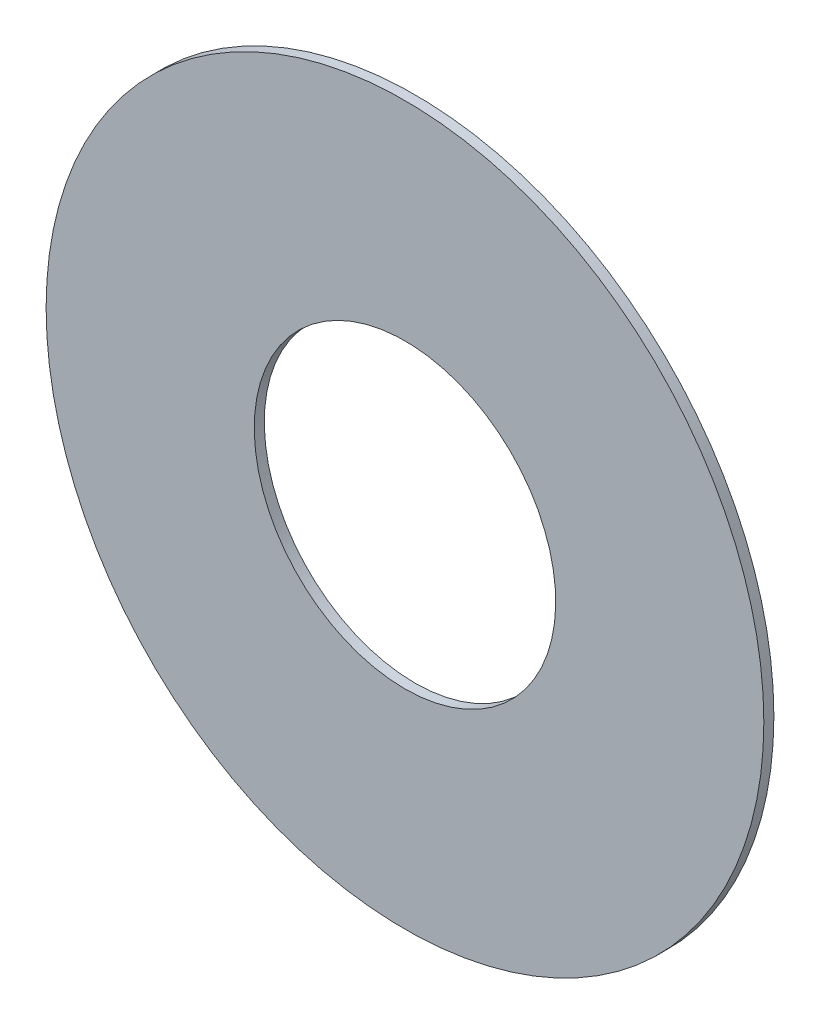
ISO-10303-21;
HEADER;
FILE_DESCRIPTION(('STEP AP214'),'2;1');
FILE_NAME('part.step','',(''),(''),'','','');
FILE_SCHEMA(('AUTOMOTIVE_DESIGN { 1 0 10303 214 1 1 1 1 }'));
ENDSEC;
DATA;
#1=APPLICATION_CONTEXT('core data for automotive mechanical design processes');
#2=APPLICATION_PROTOCOL_DEFINITION('international standard','automotive_design',2000,#1);
#3=PRODUCT_CONTEXT('',#1,'mechanical');
#4=PRODUCT('Part','Part','',(#3));
#5=PRODUCT_RELATED_PRODUCT_CATEGORY('part','',(#4));
#6=PRODUCT_DEFINITION_FORMATION('','',#4);
#7=PRODUCT_DEFINITION_CONTEXT('part definition',#1,'design');
#8=PRODUCT_DEFINITION('design','',#6,#7);
#9=PRODUCT_DEFINITION_SHAPE('','',#8);
#10=(LENGTH_UNIT() NAMED_UNIT(*) SI_UNIT(.MILLI.,.METRE.));
#11=(NAMED_UNIT(*) PLANE_ANGLE_UNIT() SI_UNIT($,.RADIAN.));
#12=(NAMED_UNIT(*) SI_UNIT($,.STERADIAN.) SOLID_ANGLE_UNIT());
#13=UNCERTAINTY_MEASURE_WITH_UNIT(LENGTH_MEASURE(1.E-05),#10,'distance_accuracy_value','');
#14=(GEOMETRIC_REPRESENTATION_CONTEXT(3) GLOBAL_UNCERTAINTY_ASSIGNED_CONTEXT((#13)) GLOBAL_UNIT_ASSIGNED_CONTEXT((#10,
#11,#12)) REPRESENTATION_CONTEXT('',''));
#15=CARTESIAN_POINT('',(0.,0.,0.));
#16=DIRECTION('',(0.,0.,1.));
#17=DIRECTION('',(1.,0.,0.));
#18=AXIS2_PLACEMENT_3D('',#15,#16,#17);
#19=CARTESIAN_POINT('',(149.102,-113.984,-0.045));
#20=DIRECTION('',(0.,0.,-1.));
#21=DIRECTION('',(0.,-1.,0.));
#22=AXIS2_PLACEMENT_3D('',#19,#20,#21);
#23=CYLINDRICAL_SURFACE('',#22,0.525);
#24=CARTESIAN_POINT('',(149.102,-113.984,-0.035));
#25=DIRECTION('',(0.,0.,-1.));
#26=DIRECTION('',(0.,-1.,0.));
#27=AXIS2_PLACEMENT_3D('',#24,#25,#26);
#28=CIRCLE('',#27,0.525);
#29=CARTESIAN_POINT('',(149.102,-114.509,-0.035));
#30=VERTEX_POINT('',#29);
#31=EDGE_CURVE('E25',#30,#30,#28,.T.);
#32=ORIENTED_EDGE('',*,*,#31,.T.);
#33=DIRECTION('',(0.,0.,1.));
#34=VECTOR('',#33,1.);
#35=CARTESIAN_POINT('',(149.102,-114.509,-0.045));
#36=LINE('',#35,#34);
#37=CARTESIAN_POINT('',(149.102,-114.509,0.));
#38=VERTEX_POINT('',#37);
#39=EDGE_CURVE('E11',#30,#38,#36,.T.);
#40=ORIENTED_EDGE('',*,*,#39,.T.);
#41=CARTESIAN_POINT('',(149.102,-113.984,0.));
#42=DIRECTION('',(0.,0.,-1.));
#43=DIRECTION('',(0.,-1.,0.));
#44=AXIS2_PLACEMENT_3D('',#41,#42,#43);
#45=CIRCLE('',#44,0.525);
#46=EDGE_CURVE('E69',#38,#38,#45,.T.);
#47=ORIENTED_EDGE('',*,*,#46,.F.);
#48=ORIENTED_EDGE('',*,*,#39,.F.);
#49=EDGE_LOOP('',(#32,#40,#47,#48));
#50=FACE_BOUND('',#49,.T.);
#51=ADVANCED_FACE('F17',(#50),#23,.F.);
#52=CARTESIAN_POINT('',(149.102,-113.984,-0.035));
#53=DIRECTION('',(0.,0.,1.));
#54=DIRECTION('',(1.,0.,0.));
#55=AXIS2_PLACEMENT_3D('',#52,#53,#54);
#56=PLANE('',#55);
#57=ORIENTED_EDGE('',*,*,#31,.F.);
#58=EDGE_LOOP('',(#57));
#59=FACE_BOUND('',#58,.T.);
#60=CARTESIAN_POINT('',(149.102,-113.984,-0.035));
#61=DIRECTION('',(0.,0.,1.));
#62=DIRECTION('',(1.,0.,0.));
#63=AXIS2_PLACEMENT_3D('',#60,#61,#62);
#64=CIRCLE('',#63,1.25);
#65=CARTESIAN_POINT('',(150.352,-113.984,-0.035));
#66=VERTEX_POINT('',#65);
#67=EDGE_CURVE('E56',#66,#66,#64,.T.);
#68=ORIENTED_EDGE('',*,*,#67,.F.);
#69=EDGE_LOOP('',(#68));
#70=FACE_BOUND('',#69,.T.);
#71=ADVANCED_FACE('F76',(#59,#70),#56,.F.);
#72=CARTESIAN_POINT('',(149.102,-113.984,0.));
#73=DIRECTION('',(0.,0.,1.));
#74=DIRECTION('',(1.,0.,0.));
#75=AXIS2_PLACEMENT_3D('',#72,#73,#74);
#76=PLANE('',#75);
#77=ORIENTED_EDGE('',*,*,#46,.T.);
#78=EDGE_LOOP('',(#77));
#79=FACE_BOUND('',#78,.T.);
#80=CARTESIAN_POINT('',(149.102,-113.984,0.));
#81=DIRECTION('',(0.,0.,1.));
#82=DIRECTION('',(1.,0.,0.));
#83=AXIS2_PLACEMENT_3D('',#80,#81,#82);
#84=CIRCLE('',#83,1.25);
#85=CARTESIAN_POINT('',(150.352,-113.984,0.));
#86=VERTEX_POINT('',#85);
#87=EDGE_CURVE('E54',#86,#86,#84,.T.);
#88=ORIENTED_EDGE('',*,*,#87,.T.);
#89=EDGE_LOOP('',(#88));
#90=FACE_BOUND('',#89,.T.);
#91=ADVANCED_FACE('F60',(#79,#90),#76,.T.);
#92=CARTESIAN_POINT('',(149.102,-113.984,-0.035));
#93=DIRECTION('',(0.,0.,1.));
#94=DIRECTION('',(1.,0.,0.));
#95=AXIS2_PLACEMENT_3D('',#92,#93,#94);
#96=CYLINDRICAL_SURFACE('',#95,1.25);
#97=ORIENTED_EDGE('',*,*,#87,.F.);
#98=DIRECTION('',(0.,0.,1.));
#99=VECTOR('',#98,1.);
#100=CARTESIAN_POINT('',(150.352,-113.984,-0.035));
#101=LINE('',#100,#99);
#102=EDGE_CURVE('E51',#66,#86,#101,.T.);
#103=ORIENTED_EDGE('',*,*,#102,.F.);
#104=ORIENTED_EDGE('',*,*,#67,.T.);
#105=ORIENTED_EDGE('',*,*,#102,.T.);
#106=EDGE_LOOP('',(#97,#103,#104,#105));
#107=FACE_BOUND('',#106,.T.);
#108=ADVANCED_FACE('F53',(#107),#96,.T.);
#109=CLOSED_SHELL('',(#51,#71,#91,#108));
#110=MANIFOLD_SOLID_BREP('B1',#109);
#111=ADVANCED_BREP_SHAPE_REPRESENTATION('',(#18,#110),#14);
#112=SHAPE_DEFINITION_REPRESENTATION(#9,#111);
ENDSEC;
END-ISO-10303-21;
